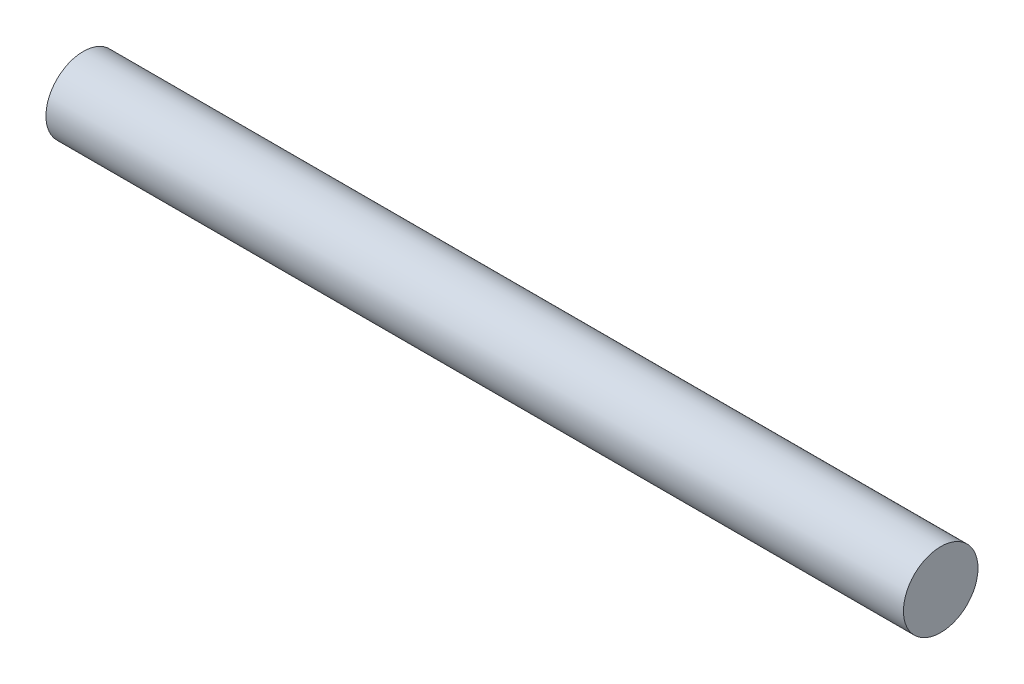
ISO-10303-21;
HEADER;
FILE_DESCRIPTION(('STEP AP214'),'2;1');
FILE_NAME('part.step','',(''),(''),'','','');
FILE_SCHEMA(('AUTOMOTIVE_DESIGN { 1 0 10303 214 1 1 1 1 }'));
ENDSEC;
DATA;
#1=APPLICATION_CONTEXT('core data for automotive mechanical design processes');
#2=APPLICATION_PROTOCOL_DEFINITION('international standard','automotive_design',2000,#1);
#3=PRODUCT_CONTEXT('',#1,'mechanical');
#4=PRODUCT('Part','Part','',(#3));
#5=PRODUCT_RELATED_PRODUCT_CATEGORY('part','',(#4));
#6=PRODUCT_DEFINITION_FORMATION('','',#4);
#7=PRODUCT_DEFINITION_CONTEXT('part definition',#1,'design');
#8=PRODUCT_DEFINITION('design','',#6,#7);
#9=PRODUCT_DEFINITION_SHAPE('','',#8);
#10=(LENGTH_UNIT() NAMED_UNIT(*) SI_UNIT(.MILLI.,.METRE.));
#11=(NAMED_UNIT(*) PLANE_ANGLE_UNIT() SI_UNIT($,.RADIAN.));
#12=(NAMED_UNIT(*) SI_UNIT($,.STERADIAN.) SOLID_ANGLE_UNIT());
#13=UNCERTAINTY_MEASURE_WITH_UNIT(LENGTH_MEASURE(1.E-05),#10,'distance_accuracy_value','');
#14=(GEOMETRIC_REPRESENTATION_CONTEXT(3) GLOBAL_UNCERTAINTY_ASSIGNED_CONTEXT((#13)) GLOBAL_UNIT_ASSIGNED_CONTEXT((#10,
#11,#12)) REPRESENTATION_CONTEXT('',''));
#15=CARTESIAN_POINT('',(0.,0.,0.));
#16=DIRECTION('',(0.,0.,1.));
#17=DIRECTION('',(1.,0.,0.));
#18=AXIS2_PLACEMENT_3D('',#15,#16,#17);
#19=CARTESIAN_POINT('',(11.5,0.,0.));
#20=DIRECTION('',(-1.,0.,0.));
#21=DIRECTION('',(0.,0.,1.));
#22=AXIS2_PLACEMENT_3D('',#19,#20,#21);
#23=CYLINDRICAL_SURFACE('',#22,1.);
#24=CARTESIAN_POINT('',(11.5,0.,0.));
#25=DIRECTION('',(1.,0.,0.));
#26=DIRECTION('',(0.,0.,-1.));
#27=AXIS2_PLACEMENT_3D('',#24,#25,#26);
#28=CIRCLE('',#27,1.);
#29=CARTESIAN_POINT('',(11.5,0.,-1.));
#30=VERTEX_POINT('',#29);
#31=EDGE_CURVE('E10',#30,#30,#28,.T.);
#32=ORIENTED_EDGE('',*,*,#31,.F.);
#33=EDGE_LOOP('',(#32));
#34=FACE_BOUND('',#33,.T.);
#35=CARTESIAN_POINT('',(-11.5,0.,0.));
#36=DIRECTION('',(1.,0.,0.));
#37=DIRECTION('',(0.,0.,-1.));
#38=AXIS2_PLACEMENT_3D('',#35,#36,#37);
#39=CIRCLE('',#38,1.);
#40=CARTESIAN_POINT('',(-11.5,0.,-1.));
#41=VERTEX_POINT('',#40);
#42=EDGE_CURVE('E46',#41,#41,#39,.T.);
#43=ORIENTED_EDGE('',*,*,#42,.T.);
#44=EDGE_LOOP('',(#43));
#45=FACE_BOUND('',#44,.T.);
#46=ADVANCED_FACE('F43',(#34,#45),#23,.T.);
#47=CARTESIAN_POINT('',(11.5,0.,0.));
#48=DIRECTION('',(1.,0.,0.));
#49=DIRECTION('',(0.,0.,-1.));
#50=AXIS2_PLACEMENT_3D('',#47,#48,#49);
#51=PLANE('',#50);
#52=ORIENTED_EDGE('',*,*,#31,.T.);
#53=EDGE_LOOP('',(#52));
#54=FACE_BOUND('',#53,.T.);
#55=ADVANCED_FACE('F60',(#54),#51,.T.);
#56=CARTESIAN_POINT('',(-11.5,0.,0.));
#57=DIRECTION('',(1.,0.,0.));
#58=DIRECTION('',(0.,0.,-1.));
#59=AXIS2_PLACEMENT_3D('',#56,#57,#58);
#60=PLANE('',#59);
#61=ORIENTED_EDGE('',*,*,#42,.F.);
#62=EDGE_LOOP('',(#61));
#63=FACE_BOUND('',#62,.T.);
#64=ADVANCED_FACE('F58',(#63),#60,.F.);
#65=CLOSED_SHELL('',(#46,#55,#64));
#66=MANIFOLD_SOLID_BREP('B2',#65);
#67=ADVANCED_BREP_SHAPE_REPRESENTATION('',(#18,#66),#14);
#68=SHAPE_DEFINITION_REPRESENTATION(#9,#67);
ENDSEC;
END-ISO-10303-21;
